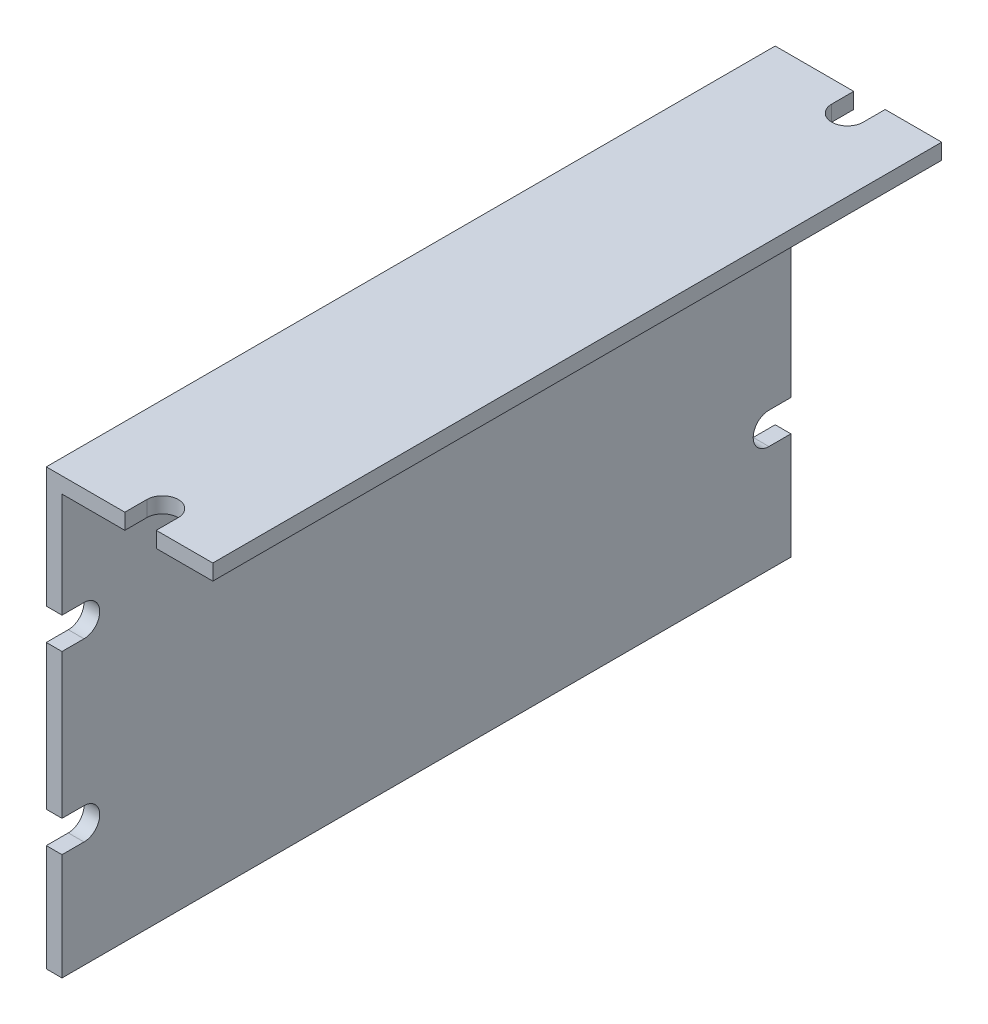
ISO-10303-21;
HEADER;
FILE_DESCRIPTION(('STEP AP214'),'2;1');
FILE_NAME('part.step','',(''),(''),'','','');
FILE_SCHEMA(('AUTOMOTIVE_DESIGN { 1 0 10303 214 1 1 1 1 }'));
ENDSEC;
DATA;
#1=APPLICATION_CONTEXT('core data for automotive mechanical design processes');
#2=APPLICATION_PROTOCOL_DEFINITION('international standard','automotive_design',2000,#1);
#3=PRODUCT_CONTEXT('',#1,'mechanical');
#4=PRODUCT('Part','Part','',(#3));
#5=PRODUCT_RELATED_PRODUCT_CATEGORY('part','',(#4));
#6=PRODUCT_DEFINITION_FORMATION('','',#4);
#7=PRODUCT_DEFINITION_CONTEXT('part definition',#1,'design');
#8=PRODUCT_DEFINITION('design','',#6,#7);
#9=PRODUCT_DEFINITION_SHAPE('','',#8);
#10=(LENGTH_UNIT() NAMED_UNIT(*) SI_UNIT(.MILLI.,.METRE.));
#11=(NAMED_UNIT(*) PLANE_ANGLE_UNIT() SI_UNIT($,.RADIAN.));
#12=(NAMED_UNIT(*) SI_UNIT($,.STERADIAN.) SOLID_ANGLE_UNIT());
#13=UNCERTAINTY_MEASURE_WITH_UNIT(LENGTH_MEASURE(1.E-05),#10,'distance_accuracy_value','');
#14=(GEOMETRIC_REPRESENTATION_CONTEXT(3) GLOBAL_UNCERTAINTY_ASSIGNED_CONTEXT((#13)) GLOBAL_UNIT_ASSIGNED_CONTEXT((#10,
#11,#12)) REPRESENTATION_CONTEXT('',''));
#15=CARTESIAN_POINT('',(0.,0.,0.));
#16=DIRECTION('',(0.,0.,1.));
#17=DIRECTION('',(1.,0.,0.));
#18=AXIS2_PLACEMENT_3D('',#15,#16,#17);
#19=CARTESIAN_POINT('',(0.,33.35,0.));
#20=DIRECTION('',(1.,0.,0.));
#21=DIRECTION('',(0.,1.,0.));
#22=AXIS2_PLACEMENT_3D('',#19,#20,#21);
#23=PLANE('',#22);
#24=DIRECTION('',(0.,1.,-4.50139245322666E-08));
#25=VECTOR('',#24,1.);
#26=CARTESIAN_POINT('',(0.,15.4,58.0000008642673));
#27=LINE('',#26,#25);
#28=CARTESIAN_POINT('',(0.,15.4,58.0000008642673));
#29=VERTEX_POINT('',#28);
#30=CARTESIAN_POINT('',(0.,34.6,58.));
#31=VERTEX_POINT('',#30);
#32=EDGE_CURVE('E28',#29,#31,#27,.T.);
#33=ORIENTED_EDGE('',*,*,#32,.T.);
#34=DIRECTION('',(0.,0.,-1.));
#35=VECTOR('',#34,1.);
#36=CARTESIAN_POINT('',(0.,34.6,58.));
#37=LINE('',#36,#35);
#38=CARTESIAN_POINT('',(0.,34.6,-58.));
#39=VERTEX_POINT('',#38);
#40=EDGE_CURVE('E475',#31,#39,#37,.T.);
#41=ORIENTED_EDGE('',*,*,#40,.T.);
#42=DIRECTION('',(0.,-1.,-4.50139245322667E-08));
#43=VECTOR('',#42,1.);
#44=CARTESIAN_POINT('',(0.,34.6,-58.));
#45=LINE('',#44,#43);
#46=CARTESIAN_POINT('',(0.,15.4,-58.0000008642673));
#47=VERTEX_POINT('',#46);
#48=EDGE_CURVE('E11',#39,#47,#45,.T.);
#49=ORIENTED_EDGE('',*,*,#48,.T.);
#50=DIRECTION('',(0.,0.,-1.));
#51=VECTOR('',#50,1.);
#52=CARTESIAN_POINT('',(0.,15.4,-54.5));
#53=LINE('',#52,#51);
#54=CARTESIAN_POINT('',(0.,15.4,-54.5));
#55=VERTEX_POINT('',#54);
#56=EDGE_CURVE('E482',#55,#47,#53,.T.);
#57=ORIENTED_EDGE('',*,*,#56,.F.);
#58=CARTESIAN_POINT('',(0.,12.9,-54.5));
#59=DIRECTION('',(1.,0.,0.));
#60=DIRECTION('',(0.,1.,0.));
#61=AXIS2_PLACEMENT_3D('',#58,#59,#60);
#62=CIRCLE('',#61,2.5);
#63=CARTESIAN_POINT('',(0.,10.4,-54.5));
#64=VERTEX_POINT('',#63);
#65=EDGE_CURVE('E349',#55,#64,#62,.T.);
#66=ORIENTED_EDGE('',*,*,#65,.T.);
#67=DIRECTION('',(0.,0.,-1.));
#68=VECTOR('',#67,1.);
#69=CARTESIAN_POINT('',(0.,10.4,-54.5));
#70=LINE('',#69,#68);
#71=CARTESIAN_POINT('',(0.,10.4,-58.0000008642673));
#72=VERTEX_POINT('',#71);
#73=EDGE_CURVE('E233',#64,#72,#70,.T.);
#74=ORIENTED_EDGE('',*,*,#73,.T.);
#75=DIRECTION('',(0.,-1.,0.));
#76=VECTOR('',#75,1.);
#77=CARTESIAN_POINT('',(0.,10.4,-58.0000008642673));
#78=LINE('',#77,#76);
#79=CARTESIAN_POINT('',(0.,-12.6,-58.0000008642673));
#80=VERTEX_POINT('',#79);
#81=EDGE_CURVE('E201',#72,#80,#78,.T.);
#82=ORIENTED_EDGE('',*,*,#81,.T.);
#83=DIRECTION('',(0.,0.,-1.));
#84=VECTOR('',#83,1.);
#85=CARTESIAN_POINT('',(0.,-12.6,-54.5));
#86=LINE('',#85,#84);
#87=CARTESIAN_POINT('',(0.,-12.6,-54.5));
#88=VERTEX_POINT('',#87);
#89=EDGE_CURVE('E365',#88,#80,#86,.T.);
#90=ORIENTED_EDGE('',*,*,#89,.F.);
#91=CARTESIAN_POINT('',(0.,-15.1,-54.5));
#92=DIRECTION('',(1.,0.,0.));
#93=DIRECTION('',(0.,1.,0.));
#94=AXIS2_PLACEMENT_3D('',#91,#92,#93);
#95=CIRCLE('',#94,2.5);
#96=CARTESIAN_POINT('',(0.,-17.6,-54.5));
#97=VERTEX_POINT('',#96);
#98=EDGE_CURVE('E217',#88,#97,#95,.T.);
#99=ORIENTED_EDGE('',*,*,#98,.T.);
#100=DIRECTION('',(0.,0.,-1.));
#101=VECTOR('',#100,1.);
#102=CARTESIAN_POINT('',(0.,-17.6,-54.5));
#103=LINE('',#102,#101);
#104=CARTESIAN_POINT('',(0.,-17.6,-58.0000008642673));
#105=VERTEX_POINT('',#104);
#106=EDGE_CURVE('E222',#97,#105,#103,.T.);
#107=ORIENTED_EDGE('',*,*,#106,.T.);
#108=DIRECTION('',(0.,-1.,5.08392559423247E-08));
#109=VECTOR('',#108,1.);
#110=CARTESIAN_POINT('',(0.,-17.6,-58.0000008642673));
#111=LINE('',#110,#109);
#112=CARTESIAN_POINT('',(0.,-34.6,-58.));
#113=VERTEX_POINT('',#112);
#114=EDGE_CURVE('E300',#105,#113,#111,.T.);
#115=ORIENTED_EDGE('',*,*,#114,.T.);
#116=DIRECTION('',(0.,0.,1.));
#117=VECTOR('',#116,1.);
#118=CARTESIAN_POINT('',(0.,-34.6,-58.));
#119=LINE('',#118,#117);
#120=CARTESIAN_POINT('',(0.,-34.6,58.));
#121=VERTEX_POINT('',#120);
#122=EDGE_CURVE('E241',#113,#121,#119,.T.);
#123=ORIENTED_EDGE('',*,*,#122,.T.);
#124=DIRECTION('',(0.,1.,5.08392559423247E-08));
#125=VECTOR('',#124,1.);
#126=CARTESIAN_POINT('',(0.,-34.6,58.));
#127=LINE('',#126,#125);
#128=CARTESIAN_POINT('',(0.,-17.6,58.0000008642673));
#129=VERTEX_POINT('',#128);
#130=EDGE_CURVE('E430',#121,#129,#127,.T.);
#131=ORIENTED_EDGE('',*,*,#130,.T.);
#132=DIRECTION('',(0.,0.,1.));
#133=VECTOR('',#132,1.);
#134=CARTESIAN_POINT('',(0.,-17.6,54.5));
#135=LINE('',#134,#133);
#136=CARTESIAN_POINT('',(0.,-17.6,54.5));
#137=VERTEX_POINT('',#136);
#138=EDGE_CURVE('E345',#137,#129,#135,.T.);
#139=ORIENTED_EDGE('',*,*,#138,.F.);
#140=CARTESIAN_POINT('',(0.,-15.1,54.5));
#141=DIRECTION('',(1.,0.,0.));
#142=DIRECTION('',(0.,-1.,0.));
#143=AXIS2_PLACEMENT_3D('',#140,#141,#142);
#144=CIRCLE('',#143,2.5);
#145=CARTESIAN_POINT('',(0.,-12.6,54.5));
#146=VERTEX_POINT('',#145);
#147=EDGE_CURVE('E319',#137,#146,#144,.T.);
#148=ORIENTED_EDGE('',*,*,#147,.T.);
#149=DIRECTION('',(0.,0.,1.));
#150=VECTOR('',#149,1.);
#151=CARTESIAN_POINT('',(0.,-12.6,54.5));
#152=LINE('',#151,#150);
#153=CARTESIAN_POINT('',(0.,-12.6,58.0000008642673));
#154=VERTEX_POINT('',#153);
#155=EDGE_CURVE('E503',#146,#154,#152,.T.);
#156=ORIENTED_EDGE('',*,*,#155,.T.);
#157=DIRECTION('',(0.,1.,0.));
#158=VECTOR('',#157,1.);
#159=CARTESIAN_POINT('',(0.,-12.6,58.0000008642673));
#160=LINE('',#159,#158);
#161=CARTESIAN_POINT('',(0.,10.4,58.0000008642673));
#162=VERTEX_POINT('',#161);
#163=EDGE_CURVE('E437',#154,#162,#160,.T.);
#164=ORIENTED_EDGE('',*,*,#163,.T.);
#165=DIRECTION('',(0.,0.,1.));
#166=VECTOR('',#165,1.);
#167=CARTESIAN_POINT('',(0.,10.4,54.5));
#168=LINE('',#167,#166);
#169=CARTESIAN_POINT('',(0.,10.4,54.5));
#170=VERTEX_POINT('',#169);
#171=EDGE_CURVE('E360',#170,#162,#168,.T.);
#172=ORIENTED_EDGE('',*,*,#171,.F.);
#173=CARTESIAN_POINT('',(0.,12.9,54.5));
#174=DIRECTION('',(1.,0.,0.));
#175=DIRECTION('',(0.,-1.,0.));
#176=AXIS2_PLACEMENT_3D('',#173,#174,#175);
#177=CIRCLE('',#176,2.5);
#178=CARTESIAN_POINT('',(0.,15.4,54.5));
#179=VERTEX_POINT('',#178);
#180=EDGE_CURVE('E284',#170,#179,#177,.T.);
#181=ORIENTED_EDGE('',*,*,#180,.T.);
#182=DIRECTION('',(0.,0.,1.));
#183=VECTOR('',#182,1.);
#184=CARTESIAN_POINT('',(0.,15.4,54.5));
#185=LINE('',#184,#183);
#186=EDGE_CURVE('E247',#179,#29,#185,.T.);
#187=ORIENTED_EDGE('',*,*,#186,.T.);
#188=EDGE_LOOP('',(#33,#41,#49,#57,#66,#74,#82,#90,#99,#107,#115,#123,#131,#139,#148,#156,#164,
#172,#181,#187));
#189=FACE_BOUND('',#188,.T.);
#190=ADVANCED_FACE('F17',(#189),#23,.F.);
#191=CARTESIAN_POINT('',(26.5,33.35,0.));
#192=DIRECTION('',(1.,0.,0.));
#193=DIRECTION('',(0.,1.,0.));
#194=AXIS2_PLACEMENT_3D('',#191,#192,#193);
#195=PLANE('',#194);
#196=DIRECTION('',(0.,0.,-1.));
#197=VECTOR('',#196,1.);
#198=CARTESIAN_POINT('',(26.5,32.1,58.));
#199=LINE('',#198,#197);
#200=CARTESIAN_POINT('',(26.5,32.1,58.0000001125348));
#201=VERTEX_POINT('',#200);
#202=CARTESIAN_POINT('',(26.5,32.1,-58.0000001125348));
#203=VERTEX_POINT('',#202);
#204=EDGE_CURVE('E155',#201,#203,#199,.T.);
#205=ORIENTED_EDGE('',*,*,#204,.T.);
#206=DIRECTION('',(0.,1.,4.50139245322667E-08));
#207=VECTOR('',#206,1.);
#208=CARTESIAN_POINT('',(26.5,34.6,-58.));
#209=LINE('',#208,#207);
#210=CARTESIAN_POINT('',(26.5,34.6,-58.));
#211=VERTEX_POINT('',#210);
#212=EDGE_CURVE('E323',#203,#211,#209,.T.);
#213=ORIENTED_EDGE('',*,*,#212,.T.);
#214=DIRECTION('',(0.,0.,1.));
#215=VECTOR('',#214,1.);
#216=CARTESIAN_POINT('',(26.5,34.6,58.));
#217=LINE('',#216,#215);
#218=CARTESIAN_POINT('',(26.5,34.6,58.));
#219=VERTEX_POINT('',#218);
#220=EDGE_CURVE('E175',#211,#219,#217,.T.);
#221=ORIENTED_EDGE('',*,*,#220,.T.);
#222=DIRECTION('',(0.,-1.,4.50139245322666E-08));
#223=VECTOR('',#222,1.);
#224=CARTESIAN_POINT('',(26.5,15.4,58.0000008642673));
#225=LINE('',#224,#223);
#226=EDGE_CURVE('E172',#219,#201,#225,.T.);
#227=ORIENTED_EDGE('',*,*,#226,.T.);
#228=EDGE_LOOP('',(#205,#213,#221,#227));
#229=FACE_BOUND('',#228,.T.);
#230=ADVANCED_FACE('F173',(#229),#195,.T.);
#231=CARTESIAN_POINT('',(0.,32.1,-58.0000001125348));
#232=DIRECTION('',(0.,4.50139245322667E-08,-1.));
#233=DIRECTION('',(-1.,0.,0.));
#234=AXIS2_PLACEMENT_3D('',#231,#232,#233);
#235=PLANE('',#234);
#236=DIRECTION('',(0.,-1.,-4.50139245322667E-08));
#237=VECTOR('',#236,1.);
#238=CARTESIAN_POINT('',(12.5,33.3500000787744,-58.0000000562674));
#239=LINE('',#238,#237);
#240=CARTESIAN_POINT('',(12.5,34.6,-58.0000008642673));
#241=VERTEX_POINT('',#240);
#242=CARTESIAN_POINT('',(12.5,32.1,-58.0000008642673));
#243=VERTEX_POINT('',#242);
#244=EDGE_CURVE('E193',#241,#243,#239,.T.);
#245=ORIENTED_EDGE('',*,*,#244,.T.);
#246=DIRECTION('',(1.,0.,0.));
#247=VECTOR('',#246,1.);
#248=CARTESIAN_POINT('',(0.,32.1,-58.0000001125348));
#249=LINE('',#248,#247);
#250=CARTESIAN_POINT('',(2.5,32.1,-58.0000001125348));
#251=VERTEX_POINT('',#250);
#252=EDGE_CURVE('E169',#251,#243,#249,.T.);
#253=ORIENTED_EDGE('',*,*,#252,.F.);
#254=DIRECTION('',(0.,1.,4.50139245322667E-08));
#255=VECTOR('',#254,1.);
#256=CARTESIAN_POINT('',(2.5,34.6,-58.));
#257=LINE('',#256,#255);
#258=CARTESIAN_POINT('',(2.5,15.4,-58.0000008642673));
#259=VERTEX_POINT('',#258);
#260=EDGE_CURVE('E421',#259,#251,#257,.T.);
#261=ORIENTED_EDGE('',*,*,#260,.F.);
#262=DIRECTION('',(1.,0.,0.));
#263=VECTOR('',#262,1.);
#264=CARTESIAN_POINT('',(0.,15.4,-58.0000008642673));
#265=LINE('',#264,#263);
#266=EDGE_CURVE('E228',#47,#259,#265,.T.);
#267=ORIENTED_EDGE('',*,*,#266,.F.);
#268=ORIENTED_EDGE('',*,*,#48,.F.);
#269=DIRECTION('',(1.,0.,0.));
#270=VECTOR('',#269,1.);
#271=CARTESIAN_POINT('',(0.,34.6,-58.));
#272=LINE('',#271,#270);
#273=EDGE_CURVE('E472',#39,#241,#272,.T.);
#274=ORIENTED_EDGE('',*,*,#273,.T.);
#275=EDGE_LOOP('',(#245,#253,#261,#267,#268,#274));
#276=FACE_BOUND('',#275,.T.);
#277=ADVANCED_FACE('F865',(#276),#235,.T.);
#278=CARTESIAN_POINT('',(0.,34.6,58.));
#279=DIRECTION('',(0.,4.50139245322666E-08,1.));
#280=DIRECTION('',(1.,0.,0.));
#281=AXIS2_PLACEMENT_3D('',#278,#279,#280);
#282=PLANE('',#281);
#283=DIRECTION('',(0.,1.,-4.50139245322666E-08));
#284=VECTOR('',#283,1.);
#285=CARTESIAN_POINT('',(12.5,34.6,58.));
#286=LINE('',#285,#284);
#287=CARTESIAN_POINT('',(12.5,32.1,58.0000008642673));
#288=VERTEX_POINT('',#287);
#289=CARTESIAN_POINT('',(12.5,34.6,58.0000008642673));
#290=VERTEX_POINT('',#289);
#291=EDGE_CURVE('E333',#288,#290,#286,.T.);
#292=ORIENTED_EDGE('',*,*,#291,.T.);
#293=DIRECTION('',(1.,0.,0.));
#294=VECTOR('',#293,1.);
#295=CARTESIAN_POINT('',(0.,34.6,58.));
#296=LINE('',#295,#294);
#297=EDGE_CURVE('E483',#31,#290,#296,.T.);
#298=ORIENTED_EDGE('',*,*,#297,.F.);
#299=ORIENTED_EDGE('',*,*,#32,.F.);
#300=DIRECTION('',(1.,0.,0.));
#301=VECTOR('',#300,1.);
#302=CARTESIAN_POINT('',(0.,15.4,58.0000008642673));
#303=LINE('',#302,#301);
#304=CARTESIAN_POINT('',(2.5,15.4,58.0000008642673));
#305=VERTEX_POINT('',#304);
#306=EDGE_CURVE('E478',#29,#305,#303,.T.);
#307=ORIENTED_EDGE('',*,*,#306,.T.);
#308=DIRECTION('',(0.,-1.,4.50139245322666E-08));
#309=VECTOR('',#308,1.);
#310=CARTESIAN_POINT('',(2.5,15.4,58.0000008642673));
#311=LINE('',#310,#309);
#312=CARTESIAN_POINT('',(2.5,32.1,58.0000001125348));
#313=VERTEX_POINT('',#312);
#314=EDGE_CURVE('E236',#313,#305,#311,.T.);
#315=ORIENTED_EDGE('',*,*,#314,.F.);
#316=DIRECTION('',(1.,0.,0.));
#317=VECTOR('',#316,1.);
#318=CARTESIAN_POINT('',(0.,32.1,58.0000001125348));
#319=LINE('',#318,#317);
#320=EDGE_CURVE('E42',#313,#288,#319,.T.);
#321=ORIENTED_EDGE('',*,*,#320,.T.);
#322=EDGE_LOOP('',(#292,#298,#299,#307,#315,#321));
#323=FACE_BOUND('',#322,.T.);
#324=ADVANCED_FACE('F937',(#323),#282,.T.);
#325=CARTESIAN_POINT('',(0.,32.1,58.));
#326=DIRECTION('',(0.,-1.,0.));
#327=DIRECTION('',(0.,0.,-1.));
#328=AXIS2_PLACEMENT_3D('',#325,#326,#327);
#329=PLANE('',#328);
#330=DIRECTION('',(0.,0.,1.));
#331=VECTOR('',#330,1.);
#332=CARTESIAN_POINT('',(12.5,32.1,58.0000004321337));
#333=LINE('',#332,#331);
#334=CARTESIAN_POINT('',(12.5,32.1,54.5));
#335=VERTEX_POINT('',#334);
#336=EDGE_CURVE('E210',#335,#288,#333,.T.);
#337=ORIENTED_EDGE('',*,*,#336,.T.);
#338=ORIENTED_EDGE('',*,*,#320,.F.);
#339=DIRECTION('',(0.,0.,-1.));
#340=VECTOR('',#339,1.);
#341=CARTESIAN_POINT('',(2.5,32.1,29.));
#342=LINE('',#341,#340);
#343=EDGE_CURVE('E422',#313,#251,#342,.T.);
#344=ORIENTED_EDGE('',*,*,#343,.T.);
#345=ORIENTED_EDGE('',*,*,#252,.T.);
#346=DIRECTION('',(0.,0.,1.));
#347=VECTOR('',#346,1.);
#348=CARTESIAN_POINT('',(12.5,32.1,1.75));
#349=LINE('',#348,#347);
#350=CARTESIAN_POINT('',(12.5,32.1,-54.5));
#351=VERTEX_POINT('',#350);
#352=EDGE_CURVE('E252',#243,#351,#349,.T.);
#353=ORIENTED_EDGE('',*,*,#352,.T.);
#354=CARTESIAN_POINT('',(15.,32.1,-54.5));
#355=DIRECTION('',(0.,1.,0.));
#356=DIRECTION('',(-1.,0.,0.));
#357=AXIS2_PLACEMENT_3D('',#354,#355,#356);
#358=CIRCLE('',#357,2.5);
#359=CARTESIAN_POINT('',(17.5,32.1,-54.5));
#360=VERTEX_POINT('',#359);
#361=EDGE_CURVE('E337',#351,#360,#358,.T.);
#362=ORIENTED_EDGE('',*,*,#361,.T.);
#363=DIRECTION('',(0.,0.,-1.));
#364=VECTOR('',#363,1.);
#365=CARTESIAN_POINT('',(17.5,32.1,-4.3213367550976E-07));
#366=LINE('',#365,#364);
#367=CARTESIAN_POINT('',(17.5,32.1,-58.0000008642673));
#368=VERTEX_POINT('',#367);
#369=EDGE_CURVE('E276',#360,#368,#366,.T.);
#370=ORIENTED_EDGE('',*,*,#369,.T.);
#371=DIRECTION('',(1.,0.,0.));
#372=VECTOR('',#371,1.);
#373=CARTESIAN_POINT('',(0.,32.1,-58.0000001125348));
#374=LINE('',#373,#372);
#375=EDGE_CURVE('E164',#368,#203,#374,.T.);
#376=ORIENTED_EDGE('',*,*,#375,.T.);
#377=ORIENTED_EDGE('',*,*,#204,.F.);
#378=DIRECTION('',(1.,0.,0.));
#379=VECTOR('',#378,1.);
#380=CARTESIAN_POINT('',(0.,32.1,58.0000001125348));
#381=LINE('',#380,#379);
#382=CARTESIAN_POINT('',(17.5,32.1,58.0000008642673));
#383=VERTEX_POINT('',#382);
#384=EDGE_CURVE('E160',#383,#201,#381,.T.);
#385=ORIENTED_EDGE('',*,*,#384,.F.);
#386=DIRECTION('',(0.,0.,-1.));
#387=VECTOR('',#386,1.);
#388=CARTESIAN_POINT('',(17.5,32.1,56.25));
#389=LINE('',#388,#387);
#390=CARTESIAN_POINT('',(17.5,32.1,54.5));
#391=VERTEX_POINT('',#390);
#392=EDGE_CURVE('E353',#383,#391,#389,.T.);
#393=ORIENTED_EDGE('',*,*,#392,.T.);
#394=CARTESIAN_POINT('',(15.,32.1,54.5));
#395=DIRECTION('',(0.,1.,0.));
#396=DIRECTION('',(1.,0.,0.));
#397=AXIS2_PLACEMENT_3D('',#394,#395,#396);
#398=CIRCLE('',#397,2.5);
#399=EDGE_CURVE('E379',#391,#335,#398,.T.);
#400=ORIENTED_EDGE('',*,*,#399,.T.);
#401=EDGE_LOOP('',(#337,#338,#344,#345,#353,#362,#370,#376,#377,#385,#393,#400));
#402=FACE_BOUND('',#401,.T.);
#403=ADVANCED_FACE('F157',(#402),#329,.T.);
#404=CARTESIAN_POINT('',(2.5,-1.25,0.));
#405=DIRECTION('',(1.,0.,0.));
#406=DIRECTION('',(0.,1.,0.));
#407=AXIS2_PLACEMENT_3D('',#404,#405,#406);
#408=PLANE('',#407);
#409=DIRECTION('',(0.,0.,-1.));
#410=VECTOR('',#409,1.);
#411=CARTESIAN_POINT('',(2.5,-12.6,-54.5));
#412=LINE('',#411,#410);
#413=CARTESIAN_POINT('',(2.5,-12.6,-54.5));
#414=VERTEX_POINT('',#413);
#415=CARTESIAN_POINT('',(2.5,-12.6,-58.0000008642673));
#416=VERTEX_POINT('',#415);
#417=EDGE_CURVE('E417',#414,#416,#412,.T.);
#418=ORIENTED_EDGE('',*,*,#417,.T.);
#419=DIRECTION('',(0.,1.,0.));
#420=VECTOR('',#419,1.);
#421=CARTESIAN_POINT('',(2.5,10.4,-58.0000008642673));
#422=LINE('',#421,#420);
#423=CARTESIAN_POINT('',(2.5,10.4,-58.0000008642673));
#424=VERTEX_POINT('',#423);
#425=EDGE_CURVE('E198',#416,#424,#422,.T.);
#426=ORIENTED_EDGE('',*,*,#425,.T.);
#427=DIRECTION('',(0.,0.,1.));
#428=VECTOR('',#427,1.);
#429=CARTESIAN_POINT('',(2.5,10.4,-54.5));
#430=LINE('',#429,#428);
#431=CARTESIAN_POINT('',(2.5,10.4,-54.5));
#432=VERTEX_POINT('',#431);
#433=EDGE_CURVE('E229',#424,#432,#430,.T.);
#434=ORIENTED_EDGE('',*,*,#433,.T.);
#435=CARTESIAN_POINT('',(2.5,12.9,-54.5));
#436=DIRECTION('',(-1.,0.,0.));
#437=DIRECTION('',(0.,1.,0.));
#438=AXIS2_PLACEMENT_3D('',#435,#436,#437);
#439=CIRCLE('',#438,2.5);
#440=CARTESIAN_POINT('',(2.5,15.4,-54.5));
#441=VERTEX_POINT('',#440);
#442=EDGE_CURVE('E489',#432,#441,#439,.T.);
#443=ORIENTED_EDGE('',*,*,#442,.T.);
#444=DIRECTION('',(0.,0.,-1.));
#445=VECTOR('',#444,1.);
#446=CARTESIAN_POINT('',(2.5,15.4,-54.5));
#447=LINE('',#446,#445);
#448=EDGE_CURVE('E223',#441,#259,#447,.T.);
#449=ORIENTED_EDGE('',*,*,#448,.T.);
#450=ORIENTED_EDGE('',*,*,#260,.T.);
#451=ORIENTED_EDGE('',*,*,#343,.F.);
#452=ORIENTED_EDGE('',*,*,#314,.T.);
#453=DIRECTION('',(0.,0.,-1.));
#454=VECTOR('',#453,1.);
#455=CARTESIAN_POINT('',(2.5,15.4,54.5));
#456=LINE('',#455,#454);
#457=CARTESIAN_POINT('',(2.5,15.4,54.5));
#458=VERTEX_POINT('',#457);
#459=EDGE_CURVE('E250',#305,#458,#456,.T.);
#460=ORIENTED_EDGE('',*,*,#459,.T.);
#461=CARTESIAN_POINT('',(2.5,12.9,54.5));
#462=DIRECTION('',(-1.,0.,0.));
#463=DIRECTION('',(0.,-1.,0.));
#464=AXIS2_PLACEMENT_3D('',#461,#462,#463);
#465=CIRCLE('',#464,2.5);
#466=CARTESIAN_POINT('',(2.5,10.4,54.5));
#467=VERTEX_POINT('',#466);
#468=EDGE_CURVE('E21',#458,#467,#465,.T.);
#469=ORIENTED_EDGE('',*,*,#468,.T.);
#470=DIRECTION('',(0.,0.,1.));
#471=VECTOR('',#470,1.);
#472=CARTESIAN_POINT('',(2.5,10.4,54.5));
#473=LINE('',#472,#471);
#474=CARTESIAN_POINT('',(2.5,10.4,58.0000008642673));
#475=VERTEX_POINT('',#474);
#476=EDGE_CURVE('E327',#467,#475,#473,.T.);
#477=ORIENTED_EDGE('',*,*,#476,.T.);
#478=DIRECTION('',(0.,-1.,0.));
#479=VECTOR('',#478,1.);
#480=CARTESIAN_POINT('',(2.5,-12.6,58.0000008642673));
#481=LINE('',#480,#479);
#482=CARTESIAN_POINT('',(2.5,-12.6,58.0000008642673));
#483=VERTEX_POINT('',#482);
#484=EDGE_CURVE('E361',#475,#483,#481,.T.);
#485=ORIENTED_EDGE('',*,*,#484,.T.);
#486=DIRECTION('',(0.,0.,-1.));
#487=VECTOR('',#486,1.);
#488=CARTESIAN_POINT('',(2.5,-12.6,54.5));
#489=LINE('',#488,#487);
#490=CARTESIAN_POINT('',(2.5,-12.6,54.5));
#491=VERTEX_POINT('',#490);
#492=EDGE_CURVE('E456',#483,#491,#489,.T.);
#493=ORIENTED_EDGE('',*,*,#492,.T.);
#494=CARTESIAN_POINT('',(2.5,-15.1,54.5));
#495=DIRECTION('',(-1.,0.,0.));
#496=DIRECTION('',(0.,-1.,0.));
#497=AXIS2_PLACEMENT_3D('',#494,#495,#496);
#498=CIRCLE('',#497,2.5);
#499=CARTESIAN_POINT('',(2.5,-17.6,54.5));
#500=VERTEX_POINT('',#499);
#501=EDGE_CURVE('E412',#491,#500,#498,.T.);
#502=ORIENTED_EDGE('',*,*,#501,.T.);
#503=DIRECTION('',(0.,0.,1.));
#504=VECTOR('',#503,1.);
#505=CARTESIAN_POINT('',(2.5,-17.6,54.5));
#506=LINE('',#505,#504);
#507=CARTESIAN_POINT('',(2.5,-17.6,58.0000008642673));
#508=VERTEX_POINT('',#507);
#509=EDGE_CURVE('E320',#500,#508,#506,.T.);
#510=ORIENTED_EDGE('',*,*,#509,.T.);
#511=DIRECTION('',(0.,-1.,-5.08392559423247E-08));
#512=VECTOR('',#511,1.);
#513=CARTESIAN_POINT('',(2.5,-34.6,58.));
#514=LINE('',#513,#512);
#515=CARTESIAN_POINT('',(2.5,-34.6,58.));
#516=VERTEX_POINT('',#515);
#517=EDGE_CURVE('E433',#508,#516,#514,.T.);
#518=ORIENTED_EDGE('',*,*,#517,.T.);
#519=DIRECTION('',(0.,0.,-1.));
#520=VECTOR('',#519,1.);
#521=CARTESIAN_POINT('',(2.5,-34.6,-58.));
#522=LINE('',#521,#520);
#523=CARTESIAN_POINT('',(2.5,-34.6,-58.));
#524=VERTEX_POINT('',#523);
#525=EDGE_CURVE('E245',#516,#524,#522,.T.);
#526=ORIENTED_EDGE('',*,*,#525,.T.);
#527=DIRECTION('',(0.,1.,-5.08392559423247E-08));
#528=VECTOR('',#527,1.);
#529=CARTESIAN_POINT('',(2.5,-17.6,-58.0000008642673));
#530=LINE('',#529,#528);
#531=CARTESIAN_POINT('',(2.5,-17.6,-58.0000008642673));
#532=VERTEX_POINT('',#531);
#533=EDGE_CURVE('E290',#524,#532,#530,.T.);
#534=ORIENTED_EDGE('',*,*,#533,.T.);
#535=DIRECTION('',(0.,0.,1.));
#536=VECTOR('',#535,1.);
#537=CARTESIAN_POINT('',(2.5,-17.6,-54.5));
#538=LINE('',#537,#536);
#539=CARTESIAN_POINT('',(2.5,-17.6,-54.5));
#540=VERTEX_POINT('',#539);
#541=EDGE_CURVE('E240',#532,#540,#538,.T.);
#542=ORIENTED_EDGE('',*,*,#541,.T.);
#543=CARTESIAN_POINT('',(2.5,-15.1,-54.5));
#544=DIRECTION('',(-1.,0.,0.));
#545=DIRECTION('',(0.,1.,0.));
#546=AXIS2_PLACEMENT_3D('',#543,#544,#545);
#547=CIRCLE('',#546,2.5);
#548=EDGE_CURVE('E216',#540,#414,#547,.T.);
#549=ORIENTED_EDGE('',*,*,#548,.T.);
#550=EDGE_LOOP('',(#418,#426,#434,#443,#449,#450,#451,#452,#460,#469,#477,#485,#493,#502,#510,
#518,#526,#534,#542,#549));
#551=FACE_BOUND('',#550,.T.);
#552=ADVANCED_FACE('F553',(#551),#408,.T.);
#553=CARTESIAN_POINT('',(0.,-12.6,-54.5));
#554=DIRECTION('',(0.,-1.,0.));
#555=DIRECTION('',(0.,0.,-1.));
#556=AXIS2_PLACEMENT_3D('',#553,#554,#555);
#557=PLANE('',#556);
#558=ORIENTED_EDGE('',*,*,#89,.T.);
#559=DIRECTION('',(1.,0.,0.));
#560=VECTOR('',#559,1.);
#561=CARTESIAN_POINT('',(0.,-12.6,-58.0000008642673));
#562=LINE('',#561,#560);
#563=EDGE_CURVE('E200',#80,#416,#562,.T.);
#564=ORIENTED_EDGE('',*,*,#563,.T.);
#565=ORIENTED_EDGE('',*,*,#417,.F.);
#566=DIRECTION('',(1.,0.,0.));
#567=VECTOR('',#566,1.);
#568=CARTESIAN_POINT('',(0.,-12.6,-54.5));
#569=LINE('',#568,#567);
#570=EDGE_CURVE('E212',#88,#414,#569,.T.);
#571=ORIENTED_EDGE('',*,*,#570,.F.);
#572=EDGE_LOOP('',(#558,#564,#565,#571));
#573=FACE_BOUND('',#572,.T.);
#574=ADVANCED_FACE('F19',(#573),#557,.T.);
#575=CARTESIAN_POINT('',(0.,-12.6,-58.0000008642673));
#576=DIRECTION('',(0.,0.,-1.));
#577=DIRECTION('',(0.,-1.,0.));
#578=AXIS2_PLACEMENT_3D('',#575,#576,#577);
#579=PLANE('',#578);
#580=ORIENTED_EDGE('',*,*,#81,.F.);
#581=DIRECTION('',(1.,0.,0.));
#582=VECTOR('',#581,1.);
#583=CARTESIAN_POINT('',(0.,10.4,-58.0000008642673));
#584=LINE('',#583,#582);
#585=EDGE_CURVE('E232',#72,#424,#584,.T.);
#586=ORIENTED_EDGE('',*,*,#585,.T.);
#587=ORIENTED_EDGE('',*,*,#425,.F.);
#588=ORIENTED_EDGE('',*,*,#563,.F.);
#589=EDGE_LOOP('',(#580,#586,#587,#588));
#590=FACE_BOUND('',#589,.T.);
#591=ADVANCED_FACE('F988',(#590),#579,.T.);
#592=CARTESIAN_POINT('',(0.,10.4,-58.0000008642673));
#593=DIRECTION('',(0.,1.,0.));
#594=DIRECTION('',(0.,0.,-1.));
#595=AXIS2_PLACEMENT_3D('',#592,#593,#594);
#596=PLANE('',#595);
#597=ORIENTED_EDGE('',*,*,#73,.F.);
#598=DIRECTION('',(1.,0.,0.));
#599=VECTOR('',#598,1.);
#600=CARTESIAN_POINT('',(0.,10.4,-54.5));
#601=LINE('',#600,#599);
#602=EDGE_CURVE('E283',#64,#432,#601,.T.);
#603=ORIENTED_EDGE('',*,*,#602,.T.);
#604=ORIENTED_EDGE('',*,*,#433,.F.);
#605=ORIENTED_EDGE('',*,*,#585,.F.);
#606=EDGE_LOOP('',(#597,#603,#604,#605));
#607=FACE_BOUND('',#606,.T.);
#608=ADVANCED_FACE('F983',(#607),#596,.T.);
#609=CARTESIAN_POINT('',(0.,12.9,-54.5));
#610=DIRECTION('',(1.,0.,0.));
#611=DIRECTION('',(0.,1.,0.));
#612=AXIS2_PLACEMENT_3D('',#609,#610,#611);
#613=CYLINDRICAL_SURFACE('',#612,2.5);
#614=ORIENTED_EDGE('',*,*,#65,.F.);
#615=DIRECTION('',(1.,0.,0.));
#616=VECTOR('',#615,1.);
#617=CARTESIAN_POINT('',(0.,15.4,-54.5));
#618=LINE('',#617,#616);
#619=EDGE_CURVE('E227',#55,#441,#618,.T.);
#620=ORIENTED_EDGE('',*,*,#619,.T.);
#621=ORIENTED_EDGE('',*,*,#442,.F.);
#622=ORIENTED_EDGE('',*,*,#602,.F.);
#623=EDGE_LOOP('',(#614,#620,#621,#622));
#624=FACE_BOUND('',#623,.T.);
#625=ADVANCED_FACE('F920',(#624),#613,.F.);
#626=CARTESIAN_POINT('',(0.,15.4,-54.5));
#627=DIRECTION('',(0.,-1.,0.));
#628=DIRECTION('',(0.,0.,-1.));
#629=AXIS2_PLACEMENT_3D('',#626,#627,#628);
#630=PLANE('',#629);
#631=ORIENTED_EDGE('',*,*,#56,.T.);
#632=ORIENTED_EDGE('',*,*,#266,.T.);
#633=ORIENTED_EDGE('',*,*,#448,.F.);
#634=ORIENTED_EDGE('',*,*,#619,.F.);
#635=EDGE_LOOP('',(#631,#632,#633,#634));
#636=FACE_BOUND('',#635,.T.);
#637=ADVANCED_FACE('F915',(#636),#630,.T.);
#638=CARTESIAN_POINT('',(0.,15.4,58.0000008642673));
#639=DIRECTION('',(0.,-1.,0.));
#640=DIRECTION('',(0.,0.,-1.));
#641=AXIS2_PLACEMENT_3D('',#638,#639,#640);
#642=PLANE('',#641);
#643=ORIENTED_EDGE('',*,*,#186,.F.);
#644=DIRECTION('',(1.,0.,0.));
#645=VECTOR('',#644,1.);
#646=CARTESIAN_POINT('',(0.,15.4,54.5));
#647=LINE('',#646,#645);
#648=EDGE_CURVE('E251',#179,#458,#647,.T.);
#649=ORIENTED_EDGE('',*,*,#648,.T.);
#650=ORIENTED_EDGE('',*,*,#459,.F.);
#651=ORIENTED_EDGE('',*,*,#306,.F.);
#652=EDGE_LOOP('',(#643,#649,#650,#651));
#653=FACE_BOUND('',#652,.T.);
#654=ADVANCED_FACE('F876',(#653),#642,.T.);
#655=CARTESIAN_POINT('',(0.,12.9,54.5));
#656=DIRECTION('',(1.,0.,0.));
#657=DIRECTION('',(0.,-1.,0.));
#658=AXIS2_PLACEMENT_3D('',#655,#656,#657);
#659=CYLINDRICAL_SURFACE('',#658,2.5);
#660=ORIENTED_EDGE('',*,*,#180,.F.);
#661=DIRECTION('',(1.,0.,0.));
#662=VECTOR('',#661,1.);
#663=CARTESIAN_POINT('',(0.,10.4,54.5));
#664=LINE('',#663,#662);
#665=EDGE_CURVE('E287',#170,#467,#664,.T.);
#666=ORIENTED_EDGE('',*,*,#665,.T.);
#667=ORIENTED_EDGE('',*,*,#468,.F.);
#668=ORIENTED_EDGE('',*,*,#648,.F.);
#669=EDGE_LOOP('',(#660,#666,#667,#668));
#670=FACE_BOUND('',#669,.T.);
#671=ADVANCED_FACE('F871',(#670),#659,.F.);
#672=CARTESIAN_POINT('',(0.,10.4,54.5));
#673=DIRECTION('',(0.,1.,0.));
#674=DIRECTION('',(1.,0.,0.));
#675=AXIS2_PLACEMENT_3D('',#672,#673,#674);
#676=PLANE('',#675);
#677=ORIENTED_EDGE('',*,*,#171,.T.);
#678=DIRECTION('',(1.,0.,0.));
#679=VECTOR('',#678,1.);
#680=CARTESIAN_POINT('',(0.,10.4,58.0000008642673));
#681=LINE('',#680,#679);
#682=EDGE_CURVE('E356',#162,#475,#681,.T.);
#683=ORIENTED_EDGE('',*,*,#682,.T.);
#684=ORIENTED_EDGE('',*,*,#476,.F.);
#685=ORIENTED_EDGE('',*,*,#665,.F.);
#686=EDGE_LOOP('',(#677,#683,#684,#685));
#687=FACE_BOUND('',#686,.T.);
#688=ADVANCED_FACE('F649',(#687),#676,.T.);
#689=CARTESIAN_POINT('',(0.,10.4,58.0000008642673));
#690=DIRECTION('',(0.,0.,1.));
#691=DIRECTION('',(1.,0.,0.));
#692=AXIS2_PLACEMENT_3D('',#689,#690,#691);
#693=PLANE('',#692);
#694=ORIENTED_EDGE('',*,*,#163,.F.);
#695=DIRECTION('',(1.,0.,0.));
#696=VECTOR('',#695,1.);
#697=CARTESIAN_POINT('',(0.,-12.6,58.0000008642673));
#698=LINE('',#697,#696);
#699=EDGE_CURVE('E446',#154,#483,#698,.T.);
#700=ORIENTED_EDGE('',*,*,#699,.T.);
#701=ORIENTED_EDGE('',*,*,#484,.F.);
#702=ORIENTED_EDGE('',*,*,#682,.F.);
#703=EDGE_LOOP('',(#694,#700,#701,#702));
#704=FACE_BOUND('',#703,.T.);
#705=ADVANCED_FACE('F651',(#704),#693,.T.);
#706=CARTESIAN_POINT('',(0.,-12.6,58.0000008642673));
#707=DIRECTION('',(0.,-1.,0.));
#708=DIRECTION('',(0.,0.,-1.));
#709=AXIS2_PLACEMENT_3D('',#706,#707,#708);
#710=PLANE('',#709);
#711=ORIENTED_EDGE('',*,*,#155,.F.);
#712=DIRECTION('',(1.,0.,0.));
#713=VECTOR('',#712,1.);
#714=CARTESIAN_POINT('',(0.,-12.6,54.5));
#715=LINE('',#714,#713);
#716=EDGE_CURVE('E416',#146,#491,#715,.T.);
#717=ORIENTED_EDGE('',*,*,#716,.T.);
#718=ORIENTED_EDGE('',*,*,#492,.F.);
#719=ORIENTED_EDGE('',*,*,#699,.F.);
#720=EDGE_LOOP('',(#711,#717,#718,#719));
#721=FACE_BOUND('',#720,.T.);
#722=ADVANCED_FACE('F653',(#721),#710,.T.);
#723=CARTESIAN_POINT('',(0.,-15.1,54.5));
#724=DIRECTION('',(1.,0.,0.));
#725=DIRECTION('',(0.,-1.,0.));
#726=AXIS2_PLACEMENT_3D('',#723,#724,#725);
#727=CYLINDRICAL_SURFACE('',#726,2.5);
#728=ORIENTED_EDGE('',*,*,#147,.F.);
#729=DIRECTION('',(1.,0.,0.));
#730=VECTOR('',#729,1.);
#731=CARTESIAN_POINT('',(0.,-17.6,54.5));
#732=LINE('',#731,#730);
#733=EDGE_CURVE('E315',#137,#500,#732,.T.);
#734=ORIENTED_EDGE('',*,*,#733,.T.);
#735=ORIENTED_EDGE('',*,*,#501,.F.);
#736=ORIENTED_EDGE('',*,*,#716,.F.);
#737=EDGE_LOOP('',(#728,#734,#735,#736));
#738=FACE_BOUND('',#737,.T.);
#739=ADVANCED_FACE('F699',(#738),#727,.F.);
#740=CARTESIAN_POINT('',(0.,-17.6,54.5));
#741=DIRECTION('',(0.,1.,0.));
#742=DIRECTION('',(1.,0.,0.));
#743=AXIS2_PLACEMENT_3D('',#740,#741,#742);
#744=PLANE('',#743);
#745=ORIENTED_EDGE('',*,*,#138,.T.);
#746=DIRECTION('',(1.,0.,0.));
#747=VECTOR('',#746,1.);
#748=CARTESIAN_POINT('',(0.,-17.6,58.0000008642673));
#749=LINE('',#748,#747);
#750=EDGE_CURVE('E382',#129,#508,#749,.T.);
#751=ORIENTED_EDGE('',*,*,#750,.T.);
#752=ORIENTED_EDGE('',*,*,#509,.F.);
#753=ORIENTED_EDGE('',*,*,#733,.F.);
#754=EDGE_LOOP('',(#745,#751,#752,#753));
#755=FACE_BOUND('',#754,.T.);
#756=ADVANCED_FACE('F702',(#755),#744,.T.);
#757=CARTESIAN_POINT('',(0.,-17.6,58.0000008642673));
#758=DIRECTION('',(0.,-5.08392559423247E-08,1.));
#759=DIRECTION('',(-1.,0.,0.));
#760=AXIS2_PLACEMENT_3D('',#757,#758,#759);
#761=PLANE('',#760);
#762=ORIENTED_EDGE('',*,*,#130,.F.);
#763=DIRECTION('',(1.,0.,0.));
#764=VECTOR('',#763,1.);
#765=CARTESIAN_POINT('',(0.,-34.6,58.));
#766=LINE('',#765,#764);
#767=EDGE_CURVE('E434',#121,#516,#766,.T.);
#768=ORIENTED_EDGE('',*,*,#767,.T.);
#769=ORIENTED_EDGE('',*,*,#517,.F.);
#770=ORIENTED_EDGE('',*,*,#750,.F.);
#771=EDGE_LOOP('',(#762,#768,#769,#770));
#772=FACE_BOUND('',#771,.T.);
#773=ADVANCED_FACE('F547',(#772),#761,.T.);
#774=CARTESIAN_POINT('',(0.,-34.6,58.));
#775=DIRECTION('',(0.,-1.,0.));
#776=DIRECTION('',(0.,0.,-1.));
#777=AXIS2_PLACEMENT_3D('',#774,#775,#776);
#778=PLANE('',#777);
#779=ORIENTED_EDGE('',*,*,#122,.F.);
#780=DIRECTION('',(1.,0.,0.));
#781=VECTOR('',#780,1.);
#782=CARTESIAN_POINT('',(0.,-34.6,-58.));
#783=LINE('',#782,#781);
#784=EDGE_CURVE('E246',#113,#524,#783,.T.);
#785=ORIENTED_EDGE('',*,*,#784,.T.);
#786=ORIENTED_EDGE('',*,*,#525,.F.);
#787=ORIENTED_EDGE('',*,*,#767,.F.);
#788=EDGE_LOOP('',(#779,#785,#786,#787));
#789=FACE_BOUND('',#788,.T.);
#790=ADVANCED_FACE('F552',(#789),#778,.T.);
#791=CARTESIAN_POINT('',(0.,-34.6,-58.));
#792=DIRECTION('',(0.,-5.08392559423247E-08,-1.));
#793=DIRECTION('',(0.,-1.,5.08392559423247E-08));
#794=AXIS2_PLACEMENT_3D('',#791,#792,#793);
#795=PLANE('',#794);
#796=ORIENTED_EDGE('',*,*,#114,.F.);
#797=DIRECTION('',(1.,0.,0.));
#798=VECTOR('',#797,1.);
#799=CARTESIAN_POINT('',(0.,-17.6,-58.0000008642673));
#800=LINE('',#799,#798);
#801=EDGE_CURVE('E310',#105,#532,#800,.T.);
#802=ORIENTED_EDGE('',*,*,#801,.T.);
#803=ORIENTED_EDGE('',*,*,#533,.F.);
#804=ORIENTED_EDGE('',*,*,#784,.F.);
#805=EDGE_LOOP('',(#796,#802,#803,#804));
#806=FACE_BOUND('',#805,.T.);
#807=ADVANCED_FACE('F909',(#806),#795,.T.);
#808=CARTESIAN_POINT('',(0.,-17.6,-58.0000008642673));
#809=DIRECTION('',(0.,1.,0.));
#810=DIRECTION('',(1.,0.,0.));
#811=AXIS2_PLACEMENT_3D('',#808,#809,#810);
#812=PLANE('',#811);
#813=ORIENTED_EDGE('',*,*,#106,.F.);
#814=DIRECTION('',(1.,0.,0.));
#815=VECTOR('',#814,1.);
#816=CARTESIAN_POINT('',(0.,-17.6,-54.5));
#817=LINE('',#816,#815);
#818=EDGE_CURVE('E218',#97,#540,#817,.T.);
#819=ORIENTED_EDGE('',*,*,#818,.T.);
#820=ORIENTED_EDGE('',*,*,#541,.F.);
#821=ORIENTED_EDGE('',*,*,#801,.F.);
#822=EDGE_LOOP('',(#813,#819,#820,#821));
#823=FACE_BOUND('',#822,.T.);
#824=ADVANCED_FACE('F960',(#823),#812,.T.);
#825=CARTESIAN_POINT('',(0.,-15.1,-54.5));
#826=DIRECTION('',(1.,0.,0.));
#827=DIRECTION('',(0.,1.,0.));
#828=AXIS2_PLACEMENT_3D('',#825,#826,#827);
#829=CYLINDRICAL_SURFACE('',#828,2.5);
#830=ORIENTED_EDGE('',*,*,#98,.F.);
#831=ORIENTED_EDGE('',*,*,#570,.T.);
#832=ORIENTED_EDGE('',*,*,#548,.F.);
#833=ORIENTED_EDGE('',*,*,#818,.F.);
#834=EDGE_LOOP('',(#830,#831,#832,#833));
#835=FACE_BOUND('',#834,.T.);
#836=ADVANCED_FACE('F965',(#835),#829,.F.);
#837=CARTESIAN_POINT('',(0.,34.6,-58.));
#838=DIRECTION('',(0.,1.,0.));
#839=DIRECTION('',(1.,0.,0.));
#840=AXIS2_PLACEMENT_3D('',#837,#838,#839);
#841=PLANE('',#840);
#842=DIRECTION('',(0.,0.,-1.));
#843=VECTOR('',#842,1.);
#844=CARTESIAN_POINT('',(12.5,34.6,4.3213367550976E-07));
#845=LINE('',#844,#843);
#846=CARTESIAN_POINT('',(12.5,34.6,54.5));
#847=VERTEX_POINT('',#846);
#848=EDGE_CURVE('E338',#290,#847,#845,.T.);
#849=ORIENTED_EDGE('',*,*,#848,.T.);
#850=CARTESIAN_POINT('',(15.,34.6,54.5));
#851=DIRECTION('',(0.,-1.,0.));
#852=DIRECTION('',(1.,0.,0.));
#853=AXIS2_PLACEMENT_3D('',#850,#851,#852);
#854=CIRCLE('',#853,2.5);
#855=CARTESIAN_POINT('',(17.5,34.6,54.5));
#856=VERTEX_POINT('',#855);
#857=EDGE_CURVE('E211',#847,#856,#854,.T.);
#858=ORIENTED_EDGE('',*,*,#857,.T.);
#859=DIRECTION('',(0.,0.,1.));
#860=VECTOR('',#859,1.);
#861=CARTESIAN_POINT('',(17.5,34.6,-1.75));
#862=LINE('',#861,#860);
#863=CARTESIAN_POINT('',(17.5,34.6,58.0000008642673));
#864=VERTEX_POINT('',#863);
#865=EDGE_CURVE('E328',#856,#864,#862,.T.);
#866=ORIENTED_EDGE('',*,*,#865,.T.);
#867=DIRECTION('',(1.,0.,0.));
#868=VECTOR('',#867,1.);
#869=CARTESIAN_POINT('',(0.,34.6,58.));
#870=LINE('',#869,#868);
#871=EDGE_CURVE('E179',#864,#219,#870,.T.);
#872=ORIENTED_EDGE('',*,*,#871,.T.);
#873=ORIENTED_EDGE('',*,*,#220,.F.);
#874=DIRECTION('',(1.,0.,0.));
#875=VECTOR('',#874,1.);
#876=CARTESIAN_POINT('',(0.,34.6,-58.));
#877=LINE('',#876,#875);
#878=CARTESIAN_POINT('',(17.5,34.6,-58.0000008642673));
#879=VERTEX_POINT('',#878);
#880=EDGE_CURVE('E205',#879,#211,#877,.T.);
#881=ORIENTED_EDGE('',*,*,#880,.F.);
#882=DIRECTION('',(0.,0.,1.));
#883=VECTOR('',#882,1.);
#884=CARTESIAN_POINT('',(17.5,34.6,-58.0000004321337));
#885=LINE('',#884,#883);
#886=CARTESIAN_POINT('',(17.5,34.6,-54.5));
#887=VERTEX_POINT('',#886);
#888=EDGE_CURVE('E267',#879,#887,#885,.T.);
#889=ORIENTED_EDGE('',*,*,#888,.T.);
#890=CARTESIAN_POINT('',(15.,34.6,-54.5));
#891=DIRECTION('',(0.,-1.,0.));
#892=DIRECTION('',(-1.,0.,0.));
#893=AXIS2_PLACEMENT_3D('',#890,#891,#892);
#894=CIRCLE('',#893,2.5);
#895=CARTESIAN_POINT('',(12.5,34.6,-54.5));
#896=VERTEX_POINT('',#895);
#897=EDGE_CURVE('E388',#887,#896,#894,.T.);
#898=ORIENTED_EDGE('',*,*,#897,.T.);
#899=DIRECTION('',(0.,0.,-1.));
#900=VECTOR('',#899,1.);
#901=CARTESIAN_POINT('',(12.5,34.6,-56.25));
#902=LINE('',#901,#900);
#903=EDGE_CURVE('E186',#896,#241,#902,.T.);
#904=ORIENTED_EDGE('',*,*,#903,.T.);
#905=ORIENTED_EDGE('',*,*,#273,.F.);
#906=ORIENTED_EDGE('',*,*,#40,.F.);
#907=ORIENTED_EDGE('',*,*,#297,.T.);
#908=EDGE_LOOP('',(#849,#858,#866,#872,#873,#881,#889,#898,#904,#905,#906,#907));
#909=FACE_BOUND('',#908,.T.);
#910=ADVANCED_FACE('F900',(#909),#841,.T.);
#911=CARTESIAN_POINT('',(0.,32.1,-58.0000001125348));
#912=DIRECTION('',(0.,4.50139245322667E-08,-1.));
#913=DIRECTION('',(-1.,0.,0.));
#914=AXIS2_PLACEMENT_3D('',#911,#912,#913);
#915=PLANE('',#914);
#916=DIRECTION('',(0.,1.,4.50139245322667E-08));
#917=VECTOR('',#916,1.);
#918=CARTESIAN_POINT('',(17.5,33.35,-58.0000000562674));
#919=LINE('',#918,#917);
#920=EDGE_CURVE('E255',#368,#879,#919,.T.);
#921=ORIENTED_EDGE('',*,*,#920,.T.);
#922=ORIENTED_EDGE('',*,*,#880,.T.);
#923=ORIENTED_EDGE('',*,*,#212,.F.);
#924=ORIENTED_EDGE('',*,*,#375,.F.);
#925=EDGE_LOOP('',(#921,#922,#923,#924));
#926=FACE_BOUND('',#925,.T.);
#927=ADVANCED_FACE('F895',(#926),#915,.T.);
#928=CARTESIAN_POINT('',(0.,34.6,58.));
#929=DIRECTION('',(0.,4.50139245322666E-08,1.));
#930=DIRECTION('',(1.,0.,0.));
#931=AXIS2_PLACEMENT_3D('',#928,#929,#930);
#932=PLANE('',#931);
#933=DIRECTION('',(0.,-1.,4.50139245322666E-08));
#934=VECTOR('',#933,1.);
#935=CARTESIAN_POINT('',(17.5,34.6000000787744,58.));
#936=LINE('',#935,#934);
#937=EDGE_CURVE('E183',#864,#383,#936,.T.);
#938=ORIENTED_EDGE('',*,*,#937,.T.);
#939=ORIENTED_EDGE('',*,*,#384,.T.);
#940=ORIENTED_EDGE('',*,*,#226,.F.);
#941=ORIENTED_EDGE('',*,*,#871,.F.);
#942=EDGE_LOOP('',(#938,#939,#940,#941));
#943=FACE_BOUND('',#942,.T.);
#944=ADVANCED_FACE('F181',(#943),#932,.T.);
#945=CARTESIAN_POINT('',(12.5,34.6,-54.5));
#946=DIRECTION('',(-1.,0.,0.));
#947=DIRECTION('',(0.,0.,1.));
#948=AXIS2_PLACEMENT_3D('',#945,#946,#947);
#949=PLANE('',#948);
#950=ORIENTED_EDGE('',*,*,#352,.F.);
#951=ORIENTED_EDGE('',*,*,#244,.F.);
#952=ORIENTED_EDGE('',*,*,#903,.F.);
#953=DIRECTION('',(0.,-1.,0.));
#954=VECTOR('',#953,1.);
#955=CARTESIAN_POINT('',(12.5,34.6,-54.5));
#956=LINE('',#955,#954);
#957=EDGE_CURVE('E384',#896,#351,#956,.T.);
#958=ORIENTED_EDGE('',*,*,#957,.T.);
#959=EDGE_LOOP('',(#950,#951,#952,#958));
#960=FACE_BOUND('',#959,.T.);
#961=ADVANCED_FACE('F883',(#960),#949,.F.);
#962=CARTESIAN_POINT('',(17.5,34.6,-58.0000008642673));
#963=DIRECTION('',(1.,0.,0.));
#964=DIRECTION('',(0.,1.,0.));
#965=AXIS2_PLACEMENT_3D('',#962,#963,#964);
#966=PLANE('',#965);
#967=ORIENTED_EDGE('',*,*,#369,.F.);
#968=DIRECTION('',(0.,-1.,0.));
#969=VECTOR('',#968,1.);
#970=CARTESIAN_POINT('',(17.5,34.6,-54.5));
#971=LINE('',#970,#969);
#972=EDGE_CURVE('E385',#887,#360,#971,.T.);
#973=ORIENTED_EDGE('',*,*,#972,.F.);
#974=ORIENTED_EDGE('',*,*,#888,.F.);
#975=ORIENTED_EDGE('',*,*,#920,.F.);
#976=EDGE_LOOP('',(#967,#973,#974,#975));
#977=FACE_BOUND('',#976,.T.);
#978=ADVANCED_FACE('F888',(#977),#966,.F.);
#979=CARTESIAN_POINT('',(15.,34.6,-54.5));
#980=DIRECTION('',(0.,-1.,0.));
#981=DIRECTION('',(-1.,0.,0.));
#982=AXIS2_PLACEMENT_3D('',#979,#980,#981);
#983=CYLINDRICAL_SURFACE('',#982,2.5);
#984=ORIENTED_EDGE('',*,*,#361,.F.);
#985=ORIENTED_EDGE('',*,*,#957,.F.);
#986=ORIENTED_EDGE('',*,*,#897,.F.);
#987=ORIENTED_EDGE('',*,*,#972,.T.);
#988=EDGE_LOOP('',(#984,#985,#986,#987));
#989=FACE_BOUND('',#988,.T.);
#990=ADVANCED_FACE('F1033',(#989),#983,.F.);
#991=CARTESIAN_POINT('',(12.5,34.6,58.0000008642673));
#992=DIRECTION('',(-1.,0.,0.));
#993=DIRECTION('',(0.,0.,1.));
#994=AXIS2_PLACEMENT_3D('',#991,#992,#993);
#995=PLANE('',#994);
#996=ORIENTED_EDGE('',*,*,#336,.F.);
#997=DIRECTION('',(0.,-1.,0.));
#998=VECTOR('',#997,1.);
#999=CARTESIAN_POINT('',(12.5,34.6,54.5));
#1000=LINE('',#999,#998);
#1001=EDGE_CURVE('E206',#847,#335,#1000,.T.);
#1002=ORIENTED_EDGE('',*,*,#1001,.F.);
#1003=ORIENTED_EDGE('',*,*,#848,.F.);
#1004=ORIENTED_EDGE('',*,*,#291,.F.);
#1005=EDGE_LOOP('',(#996,#1002,#1003,#1004));
#1006=FACE_BOUND('',#1005,.T.);
#1007=ADVANCED_FACE('F1028',(#1006),#995,.F.);
#1008=CARTESIAN_POINT('',(15.,34.6,54.5));
#1009=DIRECTION('',(0.,-1.,0.));
#1010=DIRECTION('',(1.,0.,0.));
#1011=AXIS2_PLACEMENT_3D('',#1008,#1009,#1010);
#1012=CYLINDRICAL_SURFACE('',#1011,2.5);
#1013=ORIENTED_EDGE('',*,*,#399,.F.);
#1014=DIRECTION('',(0.,-1.,0.));
#1015=VECTOR('',#1014,1.);
#1016=CARTESIAN_POINT('',(17.5,34.6,54.5));
#1017=LINE('',#1016,#1015);
#1018=EDGE_CURVE('E332',#856,#391,#1017,.T.);
#1019=ORIENTED_EDGE('',*,*,#1018,.F.);
#1020=ORIENTED_EDGE('',*,*,#857,.F.);
#1021=ORIENTED_EDGE('',*,*,#1001,.T.);
#1022=EDGE_LOOP('',(#1013,#1019,#1020,#1021));
#1023=FACE_BOUND('',#1022,.T.);
#1024=ADVANCED_FACE('F931',(#1023),#1012,.F.);
#1025=CARTESIAN_POINT('',(17.5,34.6,54.5));
#1026=DIRECTION('',(1.,0.,0.));
#1027=DIRECTION('',(0.,1.,0.));
#1028=AXIS2_PLACEMENT_3D('',#1025,#1026,#1027);
#1029=PLANE('',#1028);
#1030=ORIENTED_EDGE('',*,*,#392,.F.);
#1031=ORIENTED_EDGE('',*,*,#937,.F.);
#1032=ORIENTED_EDGE('',*,*,#865,.F.);
#1033=ORIENTED_EDGE('',*,*,#1018,.T.);
#1034=EDGE_LOOP('',(#1030,#1031,#1032,#1033));
#1035=FACE_BOUND('',#1034,.T.);
#1036=ADVANCED_FACE('F926',(#1035),#1029,.F.);
#1037=CLOSED_SHELL('',(#190,#230,#277,#324,#403,#552,#574,#591,#608,#625,#637,#654,#671,#688,
#705,#722,#739,#756,#773,#790,#807,#824,#836,#910,#927,#944,#961,#978,#990,#1007,#1024,#1036));
#1038=MANIFOLD_SOLID_BREP('B1',#1037);
#1039=ADVANCED_BREP_SHAPE_REPRESENTATION('',(#18,#1038),#14);
#1040=SHAPE_DEFINITION_REPRESENTATION(#9,#1039);
ENDSEC;
END-ISO-10303-21;
